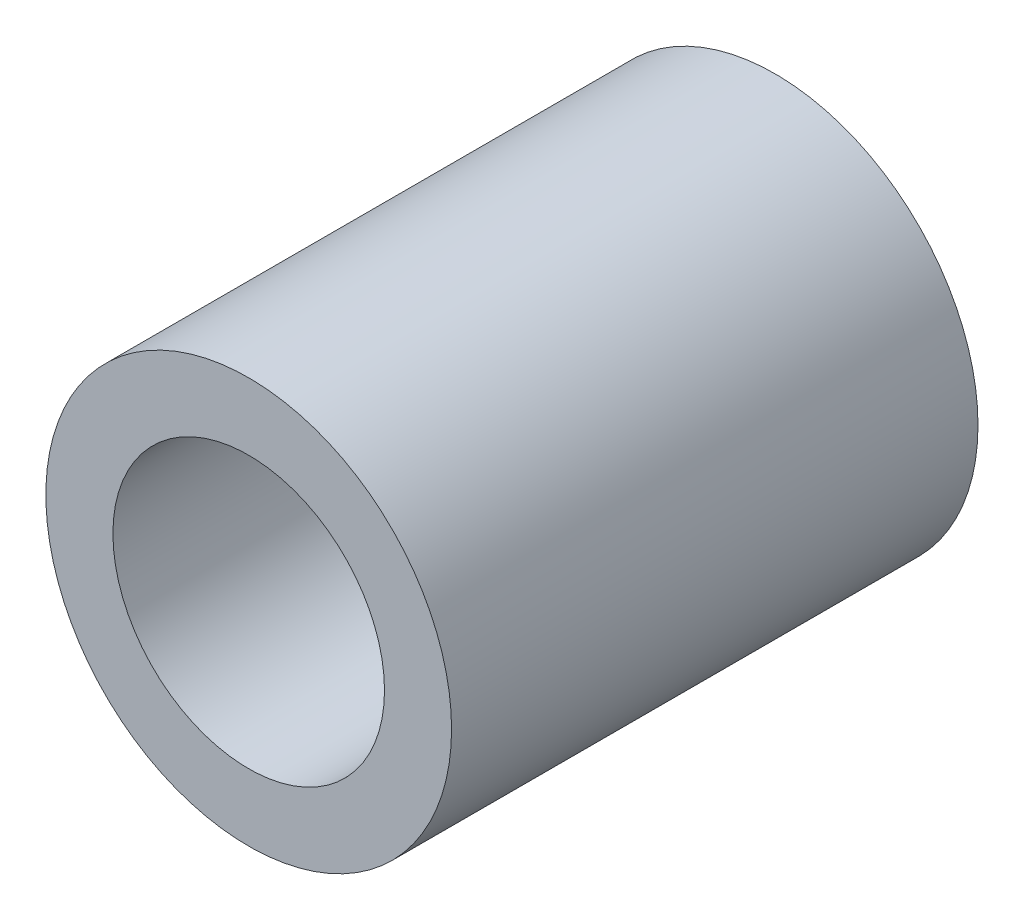
ISO-10303-21;
HEADER;
FILE_DESCRIPTION(('STEP AP214'),'2;1');
FILE_NAME('part.step','',(''),(''),'','','');
FILE_SCHEMA(('AUTOMOTIVE_DESIGN { 1 0 10303 214 1 1 1 1 }'));
ENDSEC;
DATA;
#1=APPLICATION_CONTEXT('core data for automotive mechanical design processes');
#2=APPLICATION_PROTOCOL_DEFINITION('international standard','automotive_design',2000,#1);
#3=PRODUCT_CONTEXT('',#1,'mechanical');
#4=PRODUCT('Part','Part','',(#3));
#5=PRODUCT_RELATED_PRODUCT_CATEGORY('part','',(#4));
#6=PRODUCT_DEFINITION_FORMATION('','',#4);
#7=PRODUCT_DEFINITION_CONTEXT('part definition',#1,'design');
#8=PRODUCT_DEFINITION('design','',#6,#7);
#9=PRODUCT_DEFINITION_SHAPE('','',#8);
#10=(LENGTH_UNIT() NAMED_UNIT(*) SI_UNIT(.MILLI.,.METRE.));
#11=(NAMED_UNIT(*) PLANE_ANGLE_UNIT() SI_UNIT($,.RADIAN.));
#12=(NAMED_UNIT(*) SI_UNIT($,.STERADIAN.) SOLID_ANGLE_UNIT());
#13=UNCERTAINTY_MEASURE_WITH_UNIT(LENGTH_MEASURE(1.E-05),#10,'distance_accuracy_value','');
#14=(GEOMETRIC_REPRESENTATION_CONTEXT(3) GLOBAL_UNCERTAINTY_ASSIGNED_CONTEXT((#13)) GLOBAL_UNIT_ASSIGNED_CONTEXT((#10,
#11,#12)) REPRESENTATION_CONTEXT('',''));
#15=CARTESIAN_POINT('',(0.,0.,0.));
#16=DIRECTION('',(0.,0.,1.));
#17=DIRECTION('',(1.,0.,0.));
#18=AXIS2_PLACEMENT_3D('',#15,#16,#17);
#19=CARTESIAN_POINT('',(0.,0.,15.7));
#20=DIRECTION('',(0.,0.,1.));
#21=DIRECTION('',(1.,0.,0.));
#22=AXIS2_PLACEMENT_3D('',#19,#20,#21);
#23=PLANE('',#22);
#24=CARTESIAN_POINT('',(0.,0.,15.7));
#25=DIRECTION('',(0.,0.,1.));
#26=DIRECTION('',(1.,0.,0.));
#27=AXIS2_PLACEMENT_3D('',#24,#25,#26);
#28=CIRCLE('',#27,6.05);
#29=CARTESIAN_POINT('',(6.05,0.,15.7));
#30=VERTEX_POINT('',#29);
#31=EDGE_CURVE('E10',#30,#30,#28,.T.);
#32=ORIENTED_EDGE('',*,*,#31,.T.);
#33=EDGE_LOOP('',(#32));
#34=FACE_BOUND('',#33,.T.);
#35=CARTESIAN_POINT('',(0.,0.,15.7));
#36=DIRECTION('',(0.,0.,1.));
#37=DIRECTION('',(1.,0.,0.));
#38=AXIS2_PLACEMENT_3D('',#35,#36,#37);
#39=CIRCLE('',#38,4.05);
#40=CARTESIAN_POINT('',(4.05,0.,15.7));
#41=VERTEX_POINT('',#40);
#42=EDGE_CURVE('E42',#41,#41,#39,.T.);
#43=ORIENTED_EDGE('',*,*,#42,.F.);
#44=EDGE_LOOP('',(#43));
#45=FACE_BOUND('',#44,.T.);
#46=ADVANCED_FACE('F31',(#34,#45),#23,.T.);
#47=CARTESIAN_POINT('',(0.,0.,0.));
#48=DIRECTION('',(0.,0.,1.));
#49=DIRECTION('',(1.,0.,0.));
#50=AXIS2_PLACEMENT_3D('',#47,#48,#49);
#51=PLANE('',#50);
#52=CARTESIAN_POINT('',(0.,0.,0.));
#53=DIRECTION('',(0.,0.,1.));
#54=DIRECTION('',(1.,0.,0.));
#55=AXIS2_PLACEMENT_3D('',#52,#53,#54);
#56=CIRCLE('',#55,6.05);
#57=CARTESIAN_POINT('',(6.05,0.,0.));
#58=VERTEX_POINT('',#57);
#59=EDGE_CURVE('E35',#58,#58,#56,.T.);
#60=ORIENTED_EDGE('',*,*,#59,.F.);
#61=EDGE_LOOP('',(#60));
#62=FACE_BOUND('',#61,.T.);
#63=CARTESIAN_POINT('',(0.,0.,0.));
#64=DIRECTION('',(0.,0.,1.));
#65=DIRECTION('',(1.,0.,0.));
#66=AXIS2_PLACEMENT_3D('',#63,#64,#65);
#67=CIRCLE('',#66,4.05);
#68=CARTESIAN_POINT('',(4.05,0.,0.));
#69=VERTEX_POINT('',#68);
#70=EDGE_CURVE('E44',#69,#69,#67,.T.);
#71=ORIENTED_EDGE('',*,*,#70,.T.);
#72=EDGE_LOOP('',(#71));
#73=FACE_BOUND('',#72,.T.);
#74=ADVANCED_FACE('F54',(#62,#73),#51,.F.);
#75=CARTESIAN_POINT('',(0.,0.,15.7));
#76=DIRECTION('',(0.,0.,-1.));
#77=DIRECTION('',(-1.,0.,0.));
#78=AXIS2_PLACEMENT_3D('',#75,#76,#77);
#79=CYLINDRICAL_SURFACE('',#78,6.05);
#80=ORIENTED_EDGE('',*,*,#31,.F.);
#81=EDGE_LOOP('',(#80));
#82=FACE_BOUND('',#81,.T.);
#83=ORIENTED_EDGE('',*,*,#59,.T.);
#84=EDGE_LOOP('',(#83));
#85=FACE_BOUND('',#84,.T.);
#86=ADVANCED_FACE('F33',(#82,#85),#79,.T.);
#87=CARTESIAN_POINT('',(0.,0.,15.7));
#88=DIRECTION('',(0.,0.,-1.));
#89=DIRECTION('',(-1.,0.,0.));
#90=AXIS2_PLACEMENT_3D('',#87,#88,#89);
#91=CYLINDRICAL_SURFACE('',#90,4.05);
#92=ORIENTED_EDGE('',*,*,#42,.T.);
#93=EDGE_LOOP('',(#92));
#94=FACE_BOUND('',#93,.T.);
#95=ORIENTED_EDGE('',*,*,#70,.F.);
#96=EDGE_LOOP('',(#95));
#97=FACE_BOUND('',#96,.T.);
#98=ADVANCED_FACE('F50',(#94,#97),#91,.F.);
#99=CLOSED_SHELL('',(#46,#74,#86,#98));
#100=MANIFOLD_SOLID_BREP('B2',#99);
#101=ADVANCED_BREP_SHAPE_REPRESENTATION('',(#18,#100),#14);
#102=SHAPE_DEFINITION_REPRESENTATION(#9,#101);
ENDSEC;
END-ISO-10303-21;
